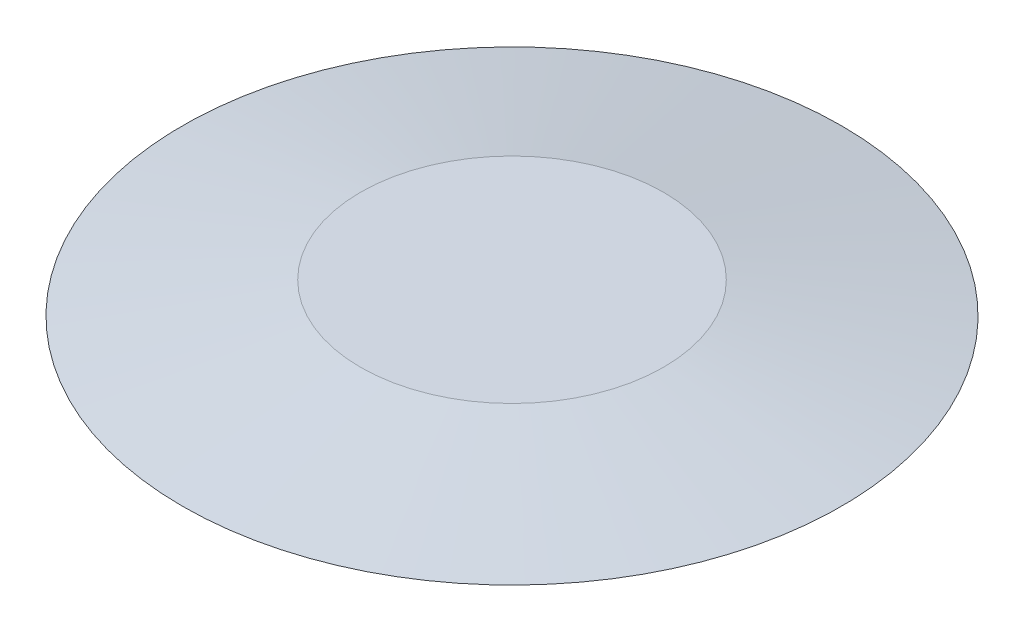
ISO-10303-21;
HEADER;
FILE_DESCRIPTION(('STEP AP214'),'2;1');
FILE_NAME('part.step','',(''),(''),'','','');
FILE_SCHEMA(('AUTOMOTIVE_DESIGN { 1 0 10303 214 1 1 1 1 }'));
ENDSEC;
DATA;
#1=APPLICATION_CONTEXT('core data for automotive mechanical design processes');
#2=APPLICATION_PROTOCOL_DEFINITION('international standard','automotive_design',2000,#1);
#3=PRODUCT_CONTEXT('',#1,'mechanical');
#4=PRODUCT('Part','Part','',(#3));
#5=PRODUCT_RELATED_PRODUCT_CATEGORY('part','',(#4));
#6=PRODUCT_DEFINITION_FORMATION('','',#4);
#7=PRODUCT_DEFINITION_CONTEXT('part definition',#1,'design');
#8=PRODUCT_DEFINITION('design','',#6,#7);
#9=PRODUCT_DEFINITION_SHAPE('','',#8);
#10=(LENGTH_UNIT() NAMED_UNIT(*) SI_UNIT(.MILLI.,.METRE.));
#11=(NAMED_UNIT(*) PLANE_ANGLE_UNIT() SI_UNIT($,.RADIAN.));
#12=(NAMED_UNIT(*) SI_UNIT($,.STERADIAN.) SOLID_ANGLE_UNIT());
#13=UNCERTAINTY_MEASURE_WITH_UNIT(LENGTH_MEASURE(1.E-05),#10,'distance_accuracy_value','');
#14=(GEOMETRIC_REPRESENTATION_CONTEXT(3) GLOBAL_UNCERTAINTY_ASSIGNED_CONTEXT((#13)) GLOBAL_UNIT_ASSIGNED_CONTEXT((#10,
#11,#12)) REPRESENTATION_CONTEXT('',''));
#15=CARTESIAN_POINT('',(0.,0.,0.));
#16=DIRECTION('',(0.,0.,1.));
#17=DIRECTION('',(1.,0.,0.));
#18=AXIS2_PLACEMENT_3D('',#15,#16,#17);
#19=CARTESIAN_POINT('',(0.,0.,0.));
#20=DIRECTION('',(0.,-1.,0.));
#21=DIRECTION('',(0.,0.,1.));
#22=AXIS2_PLACEMENT_3D('',#19,#20,#21);
#23=CONICAL_SURFACE('',#22,26.67,1.39626340159547);
#24=CARTESIAN_POINT('',(0.,2.54,0.));
#25=DIRECTION('',(0.,1.,0.));
#26=DIRECTION('',(0.,0.,1.));
#27=AXIS2_PLACEMENT_3D('',#24,#25,#26);
#28=CIRCLE('',#27,12.2649441781709);
#29=CARTESIAN_POINT('',(0.,2.54,12.2649441781709));
#30=VERTEX_POINT('',#29);
#31=EDGE_CURVE('E10',#30,#30,#28,.T.);
#32=ORIENTED_EDGE('',*,*,#31,.F.);
#33=EDGE_LOOP('',(#32));
#34=FACE_BOUND('',#33,.T.);
#35=CARTESIAN_POINT('',(0.,0.,0.));
#36=DIRECTION('',(0.,1.,0.));
#37=DIRECTION('',(0.,0.,1.));
#38=AXIS2_PLACEMENT_3D('',#35,#36,#37);
#39=CIRCLE('',#38,26.67);
#40=CARTESIAN_POINT('',(0.,0.,26.67));
#41=VERTEX_POINT('',#40);
#42=EDGE_CURVE('E37',#41,#41,#39,.T.);
#43=ORIENTED_EDGE('',*,*,#42,.T.);
#44=EDGE_LOOP('',(#43));
#45=FACE_BOUND('',#44,.T.);
#46=ADVANCED_FACE('F31',(#34,#45),#23,.T.);
#47=CARTESIAN_POINT('',(0.,2.54,0.));
#48=DIRECTION('',(0.,1.,0.));
#49=DIRECTION('',(0.,0.,1.));
#50=AXIS2_PLACEMENT_3D('',#47,#48,#49);
#51=PLANE('',#50);
#52=ORIENTED_EDGE('',*,*,#31,.T.);
#53=EDGE_LOOP('',(#52));
#54=FACE_BOUND('',#53,.T.);
#55=ADVANCED_FACE('F46',(#54),#51,.T.);
#56=CARTESIAN_POINT('',(0.,0.,0.));
#57=DIRECTION('',(0.,1.,0.));
#58=DIRECTION('',(0.,0.,1.));
#59=AXIS2_PLACEMENT_3D('',#56,#57,#58);
#60=PLANE('',#59);
#61=ORIENTED_EDGE('',*,*,#42,.F.);
#62=EDGE_LOOP('',(#61));
#63=FACE_BOUND('',#62,.T.);
#64=ADVANCED_FACE('F44',(#63),#60,.F.);
#65=CLOSED_SHELL('',(#46,#55,#64));
#66=MANIFOLD_SOLID_BREP('B2',#65);
#67=ADVANCED_BREP_SHAPE_REPRESENTATION('',(#18,#66),#14);
#68=SHAPE_DEFINITION_REPRESENTATION(#9,#67);
ENDSEC;
END-ISO-10303-21;
